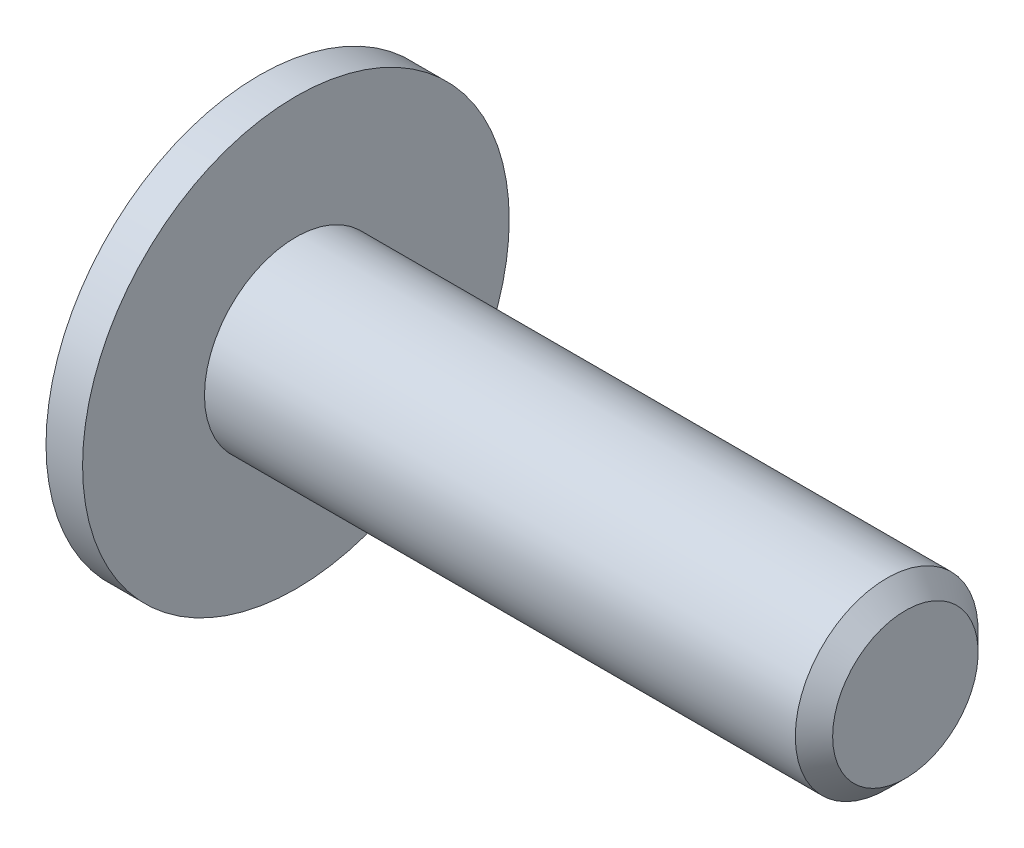
ISO-10303-21;
HEADER;
FILE_DESCRIPTION(('STEP AP214'),'2;1');
FILE_NAME('part.step','',(''),(''),'','','');
FILE_SCHEMA(('AUTOMOTIVE_DESIGN { 1 0 10303 214 1 1 1 1 }'));
ENDSEC;
DATA;
#1=APPLICATION_CONTEXT('core data for automotive mechanical design processes');
#2=APPLICATION_PROTOCOL_DEFINITION('international standard','automotive_design',2000,#1);
#3=PRODUCT_CONTEXT('',#1,'mechanical');
#4=PRODUCT('Part','Part','',(#3));
#5=PRODUCT_RELATED_PRODUCT_CATEGORY('part','',(#4));
#6=PRODUCT_DEFINITION_FORMATION('','',#4);
#7=PRODUCT_DEFINITION_CONTEXT('part definition',#1,'design');
#8=PRODUCT_DEFINITION('design','',#6,#7);
#9=PRODUCT_DEFINITION_SHAPE('','',#8);
#10=(LENGTH_UNIT() NAMED_UNIT(*) SI_UNIT(.MILLI.,.METRE.));
#11=(NAMED_UNIT(*) PLANE_ANGLE_UNIT() SI_UNIT($,.RADIAN.));
#12=(NAMED_UNIT(*) SI_UNIT($,.STERADIAN.) SOLID_ANGLE_UNIT());
#13=UNCERTAINTY_MEASURE_WITH_UNIT(LENGTH_MEASURE(1.E-05),#10,'distance_accuracy_value','');
#14=(GEOMETRIC_REPRESENTATION_CONTEXT(3) GLOBAL_UNCERTAINTY_ASSIGNED_CONTEXT((#13)) GLOBAL_UNIT_ASSIGNED_CONTEXT((#10,
#11,#12)) REPRESENTATION_CONTEXT('',''));
#15=CARTESIAN_POINT('',(0.,0.,0.));
#16=DIRECTION('',(0.,0.,1.));
#17=DIRECTION('',(1.,0.,0.));
#18=AXIS2_PLACEMENT_3D('',#15,#16,#17);
#19=CARTESIAN_POINT('',(-1.65,0.,0.));
#20=DIRECTION('',(1.,0.,0.));
#21=DIRECTION('',(0.,0.,-1.));
#22=AXIS2_PLACEMENT_3D('',#19,#20,#21);
#23=PLANE('',#22);
#24=CARTESIAN_POINT('',(-1.65,0.,0.));
#25=DIRECTION('',(-1.,0.,0.));
#26=DIRECTION('',(0.,0.,1.));
#27=AXIS2_PLACEMENT_3D('',#24,#25,#26);
#28=CIRCLE('',#27,1.95);
#29=CARTESIAN_POINT('',(-1.65,0.,1.95));
#30=VERTEX_POINT('',#29);
#31=EDGE_CURVE('E11',#30,#30,#28,.T.);
#32=ORIENTED_EDGE('',*,*,#31,.T.);
#33=EDGE_LOOP('',(#32));
#34=FACE_BOUND('',#33,.T.);
#35=DIRECTION('',(0.,-1.,0.));
#36=VECTOR('',#35,1.);
#37=CARTESIAN_POINT('',(-1.65,0.57735026918963,1.));
#38=LINE('',#37,#36);
#39=CARTESIAN_POINT('',(-1.65,0.57735026918963,1.));
#40=VERTEX_POINT('',#39);
#41=CARTESIAN_POINT('',(-1.65,-0.57735026918963,1.));
#42=VERTEX_POINT('',#41);
#43=EDGE_CURVE('E53',#40,#42,#38,.T.);
#44=ORIENTED_EDGE('',*,*,#43,.T.);
#45=DIRECTION('',(0.,-0.500000000000029,-0.866025403784422));
#46=VECTOR('',#45,1.);
#47=CARTESIAN_POINT('',(-1.65,-0.57735026918963,1.));
#48=LINE('',#47,#46);
#49=CARTESIAN_POINT('',(-1.65,-1.1547005383793,0.));
#50=VERTEX_POINT('',#49);
#51=EDGE_CURVE('E124',#42,#50,#48,.T.);
#52=ORIENTED_EDGE('',*,*,#51,.T.);
#53=DIRECTION('',(0.,0.500000000000029,-0.866025403784422));
#54=VECTOR('',#53,1.);
#55=CARTESIAN_POINT('',(-1.65,-1.1547005383793,0.));
#56=LINE('',#55,#54);
#57=CARTESIAN_POINT('',(-1.65,-0.57735026918963,-1.));
#58=VERTEX_POINT('',#57);
#59=EDGE_CURVE('E127',#50,#58,#56,.T.);
#60=ORIENTED_EDGE('',*,*,#59,.T.);
#61=DIRECTION('',(0.,1.,0.));
#62=VECTOR('',#61,1.);
#63=CARTESIAN_POINT('',(-1.65,-0.57735026918963,-1.));
#64=LINE('',#63,#62);
#65=CARTESIAN_POINT('',(-1.65,0.57735026918963,-1.));
#66=VERTEX_POINT('',#65);
#67=EDGE_CURVE('E130',#58,#66,#64,.T.);
#68=ORIENTED_EDGE('',*,*,#67,.T.);
#69=DIRECTION('',(0.,0.500000000000029,0.866025403784422));
#70=VECTOR('',#69,1.);
#71=CARTESIAN_POINT('',(-1.65,0.57735026918963,-1.));
#72=LINE('',#71,#70);
#73=CARTESIAN_POINT('',(-1.65,1.1547005383793,0.));
#74=VERTEX_POINT('',#73);
#75=EDGE_CURVE('E114',#66,#74,#72,.T.);
#76=ORIENTED_EDGE('',*,*,#75,.T.);
#77=DIRECTION('',(0.,-0.500000000000029,0.866025403784422));
#78=VECTOR('',#77,1.);
#79=CARTESIAN_POINT('',(-1.65,1.1547005383793,0.));
#80=LINE('',#79,#78);
#81=EDGE_CURVE('E133',#74,#40,#80,.T.);
#82=ORIENTED_EDGE('',*,*,#81,.T.);
#83=EDGE_LOOP('',(#44,#52,#60,#68,#76,#82));
#84=FACE_BOUND('',#83,.T.);
#85=ADVANCED_FACE('F39',(#34,#84),#23,.F.);
#86=CARTESIAN_POINT('',(-0.27250139549985,0.,0.));
#87=DIRECTION('',(-1.,0.,0.));
#88=DIRECTION('',(0.,0.,1.));
#89=AXIS2_PLACEMENT_3D('',#86,#87,#88);
#90=DEGENERATE_TOROIDAL_SURFACE('',#89,0.897886869653605,1.73333333333411,.T.);
#91=ORIENTED_EDGE('',*,*,#31,.F.);
#92=EDGE_LOOP('',(#91));
#93=FACE_BOUND('',#92,.T.);
#94=CARTESIAN_POINT('',(-0.6,0.,0.));
#95=DIRECTION('',(-1.,0.,0.));
#96=DIRECTION('',(0.,0.,1.));
#97=AXIS2_PLACEMENT_3D('',#94,#95,#96);
#98=CIRCLE('',#97,2.6);
#99=CARTESIAN_POINT('',(-0.6,0.,2.6));
#100=VERTEX_POINT('',#99);
#101=EDGE_CURVE('E46',#100,#100,#98,.T.);
#102=ORIENTED_EDGE('',*,*,#101,.T.);
#103=EDGE_LOOP('',(#102));
#104=FACE_BOUND('',#103,.T.);
#105=ADVANCED_FACE('F161',(#93,#104),#90,.T.);
#106=CARTESIAN_POINT('',(-0.6,2.6,0.));
#107=DIRECTION('',(1.,0.,0.));
#108=DIRECTION('',(0.,0.,-1.));
#109=AXIS2_PLACEMENT_3D('',#106,#107,#108);
#110=PLANE('',#109);
#111=ORIENTED_EDGE('',*,*,#101,.F.);
#112=EDGE_LOOP('',(#111));
#113=FACE_BOUND('',#112,.T.);
#114=CARTESIAN_POINT('',(-0.6,0.,0.));
#115=DIRECTION('',(-1.,0.,0.));
#116=DIRECTION('',(0.,0.,1.));
#117=AXIS2_PLACEMENT_3D('',#114,#115,#116);
#118=CIRCLE('',#117,3.5);
#119=CARTESIAN_POINT('',(-0.6,0.,3.5));
#120=VERTEX_POINT('',#119);
#121=EDGE_CURVE('E156',#120,#120,#118,.T.);
#122=ORIENTED_EDGE('',*,*,#121,.T.);
#123=EDGE_LOOP('',(#122));
#124=FACE_BOUND('',#123,.T.);
#125=ADVANCED_FACE('F163',(#113,#124),#110,.F.);
#126=CARTESIAN_POINT('',(10.,0.,0.));
#127=DIRECTION('',(-1.,0.,0.));
#128=DIRECTION('',(0.,0.,1.));
#129=AXIS2_PLACEMENT_3D('',#126,#127,#128);
#130=CYLINDRICAL_SURFACE('',#129,3.5);
#131=ORIENTED_EDGE('',*,*,#121,.F.);
#132=EDGE_LOOP('',(#131));
#133=FACE_BOUND('',#132,.T.);
#134=CARTESIAN_POINT('',(0.,0.,0.));
#135=DIRECTION('',(-1.,0.,0.));
#136=DIRECTION('',(0.,0.,1.));
#137=AXIS2_PLACEMENT_3D('',#134,#135,#136);
#138=CIRCLE('',#137,3.5);
#139=CARTESIAN_POINT('',(0.,0.,3.5));
#140=VERTEX_POINT('',#139);
#141=EDGE_CURVE('E153',#140,#140,#138,.T.);
#142=ORIENTED_EDGE('',*,*,#141,.T.);
#143=EDGE_LOOP('',(#142));
#144=FACE_BOUND('',#143,.T.);
#145=ADVANCED_FACE('F166',(#133,#144),#130,.T.);
#146=CARTESIAN_POINT('',(0.,3.5,0.));
#147=DIRECTION('',(-1.,0.,0.));
#148=DIRECTION('',(0.,0.,1.));
#149=AXIS2_PLACEMENT_3D('',#146,#147,#148);
#150=PLANE('',#149);
#151=ORIENTED_EDGE('',*,*,#141,.F.);
#152=EDGE_LOOP('',(#151));
#153=FACE_BOUND('',#152,.T.);
#154=CARTESIAN_POINT('',(0.,0.,0.));
#155=DIRECTION('',(-1.,0.,0.));
#156=DIRECTION('',(0.,0.,1.));
#157=AXIS2_PLACEMENT_3D('',#154,#155,#156);
#158=CIRCLE('',#157,1.5);
#159=CARTESIAN_POINT('',(0.,0.,1.5));
#160=VERTEX_POINT('',#159);
#161=EDGE_CURVE('E150',#160,#160,#158,.T.);
#162=ORIENTED_EDGE('',*,*,#161,.T.);
#163=EDGE_LOOP('',(#162));
#164=FACE_BOUND('',#163,.T.);
#165=ADVANCED_FACE('F172',(#153,#164),#150,.F.);
#166=CARTESIAN_POINT('',(10.,0.,0.));
#167=DIRECTION('',(-1.,0.,0.));
#168=DIRECTION('',(0.,0.,1.));
#169=AXIS2_PLACEMENT_3D('',#166,#167,#168);
#170=CYLINDRICAL_SURFACE('',#169,1.5);
#171=ORIENTED_EDGE('',*,*,#161,.F.);
#172=EDGE_LOOP('',(#171));
#173=FACE_BOUND('',#172,.T.);
#174=CARTESIAN_POINT('',(9.6935,0.,0.));
#175=DIRECTION('',(-1.,0.,0.));
#176=DIRECTION('',(0.,0.,1.));
#177=AXIS2_PLACEMENT_3D('',#174,#175,#176);
#178=CIRCLE('',#177,1.5);
#179=CARTESIAN_POINT('',(9.6935,0.,1.5));
#180=VERTEX_POINT('',#179);
#181=EDGE_CURVE('E147',#180,#180,#178,.T.);
#182=ORIENTED_EDGE('',*,*,#181,.T.);
#183=EDGE_LOOP('',(#182));
#184=FACE_BOUND('',#183,.T.);
#185=ADVANCED_FACE('F178',(#173,#184),#170,.T.);
#186=CARTESIAN_POINT('',(10.,0.,0.));
#187=DIRECTION('',(-1.,0.,0.));
#188=DIRECTION('',(0.,0.,1.));
#189=AXIS2_PLACEMENT_3D('',#186,#187,#188);
#190=CONICAL_SURFACE('',#189,1.1935,0.785398163397448);
#191=ORIENTED_EDGE('',*,*,#181,.F.);
#192=EDGE_LOOP('',(#191));
#193=FACE_BOUND('',#192,.T.);
#194=CARTESIAN_POINT('',(10.,0.,0.));
#195=DIRECTION('',(-1.,0.,0.));
#196=DIRECTION('',(0.,0.,1.));
#197=AXIS2_PLACEMENT_3D('',#194,#195,#196);
#198=CIRCLE('',#197,1.1935);
#199=CARTESIAN_POINT('',(10.,0.,1.1935));
#200=VERTEX_POINT('',#199);
#201=EDGE_CURVE('E144',#200,#200,#198,.T.);
#202=ORIENTED_EDGE('',*,*,#201,.T.);
#203=EDGE_LOOP('',(#202));
#204=FACE_BOUND('',#203,.T.);
#205=ADVANCED_FACE('F184',(#193,#204),#190,.T.);
#206=CARTESIAN_POINT('',(10.,1.1935,0.));
#207=DIRECTION('',(-1.,0.,0.));
#208=DIRECTION('',(0.,0.,1.));
#209=AXIS2_PLACEMENT_3D('',#206,#207,#208);
#210=PLANE('',#209);
#211=ORIENTED_EDGE('',*,*,#201,.F.);
#212=EDGE_LOOP('',(#211));
#213=FACE_BOUND('',#212,.T.);
#214=ADVANCED_FACE('F190',(#213),#210,.F.);
#215=CARTESIAN_POINT('',(-0.6,0.57735026918963,1.));
#216=DIRECTION('',(0.,0.,-1.));
#217=DIRECTION('',(-1.,0.,0.));
#218=AXIS2_PLACEMENT_3D('',#215,#216,#217);
#219=PLANE('',#218);
#220=ORIENTED_EDGE('',*,*,#43,.F.);
#221=DIRECTION('',(-1.,0.,0.));
#222=VECTOR('',#221,1.);
#223=CARTESIAN_POINT('',(-0.6,0.57735026918963,1.));
#224=LINE('',#223,#222);
#225=CARTESIAN_POINT('',(-0.6,0.57735026918963,1.));
#226=VERTEX_POINT('',#225);
#227=EDGE_CURVE('E119',#226,#40,#224,.T.);
#228=ORIENTED_EDGE('',*,*,#227,.F.);
#229=DIRECTION('',(0.,-1.,0.));
#230=VECTOR('',#229,1.);
#231=CARTESIAN_POINT('',(-0.6,0.57735026918963,1.));
#232=LINE('',#231,#230);
#233=CARTESIAN_POINT('',(-0.6,-0.57735026918963,1.));
#234=VERTEX_POINT('',#233);
#235=EDGE_CURVE('E136',#226,#234,#232,.T.);
#236=ORIENTED_EDGE('',*,*,#235,.T.);
#237=DIRECTION('',(-1.,0.,0.));
#238=VECTOR('',#237,1.);
#239=CARTESIAN_POINT('',(-0.6,-0.57735026918963,1.));
#240=LINE('',#239,#238);
#241=EDGE_CURVE('E142',#234,#42,#240,.T.);
#242=ORIENTED_EDGE('',*,*,#241,.T.);
#243=EDGE_LOOP('',(#220,#228,#236,#242));
#244=FACE_BOUND('',#243,.T.);
#245=ADVANCED_FACE('F195',(#244),#219,.T.);
#246=CARTESIAN_POINT('',(-0.6,-0.57735026918963,1.));
#247=DIRECTION('',(0.,0.866025403784422,-0.500000000000029));
#248=DIRECTION('',(0.,0.500000000000029,0.866025403784422));
#249=AXIS2_PLACEMENT_3D('',#246,#247,#248);
#250=PLANE('',#249);
#251=ORIENTED_EDGE('',*,*,#51,.F.);
#252=ORIENTED_EDGE('',*,*,#241,.F.);
#253=DIRECTION('',(0.,-0.500000000000029,-0.866025403784422));
#254=VECTOR('',#253,1.);
#255=CARTESIAN_POINT('',(-0.6,-0.57735026918963,1.));
#256=LINE('',#255,#254);
#257=CARTESIAN_POINT('',(-0.6,-1.1547005383793,0.));
#258=VERTEX_POINT('',#257);
#259=EDGE_CURVE('E92',#234,#258,#256,.T.);
#260=ORIENTED_EDGE('',*,*,#259,.T.);
#261=DIRECTION('',(-1.,0.,0.));
#262=VECTOR('',#261,1.);
#263=CARTESIAN_POINT('',(-0.6,-1.1547005383793,0.));
#264=LINE('',#263,#262);
#265=EDGE_CURVE('E140',#258,#50,#264,.T.);
#266=ORIENTED_EDGE('',*,*,#265,.T.);
#267=EDGE_LOOP('',(#251,#252,#260,#266));
#268=FACE_BOUND('',#267,.T.);
#269=ADVANCED_FACE('F200',(#268),#250,.T.);
#270=CARTESIAN_POINT('',(-0.6,-1.1547005383793,0.));
#271=DIRECTION('',(0.,0.866025403784422,0.500000000000029));
#272=DIRECTION('',(0.,-0.500000000000029,0.866025403784422));
#273=AXIS2_PLACEMENT_3D('',#270,#271,#272);
#274=PLANE('',#273);
#275=ORIENTED_EDGE('',*,*,#59,.F.);
#276=ORIENTED_EDGE('',*,*,#265,.F.);
#277=DIRECTION('',(0.,0.500000000000029,-0.866025403784422));
#278=VECTOR('',#277,1.);
#279=CARTESIAN_POINT('',(-0.6,-1.1547005383793,0.));
#280=LINE('',#279,#278);
#281=CARTESIAN_POINT('',(-0.6,-0.57735026918963,-1.));
#282=VERTEX_POINT('',#281);
#283=EDGE_CURVE('E110',#258,#282,#280,.T.);
#284=ORIENTED_EDGE('',*,*,#283,.T.);
#285=DIRECTION('',(-1.,0.,0.));
#286=VECTOR('',#285,1.);
#287=CARTESIAN_POINT('',(-0.6,-0.57735026918963,-1.));
#288=LINE('',#287,#286);
#289=EDGE_CURVE('E107',#282,#58,#288,.T.);
#290=ORIENTED_EDGE('',*,*,#289,.T.);
#291=EDGE_LOOP('',(#275,#276,#284,#290));
#292=FACE_BOUND('',#291,.T.);
#293=ADVANCED_FACE('F217',(#292),#274,.T.);
#294=CARTESIAN_POINT('',(-0.6,-0.57735026918963,-1.));
#295=DIRECTION('',(0.,0.,1.));
#296=DIRECTION('',(1.,0.,0.));
#297=AXIS2_PLACEMENT_3D('',#294,#295,#296);
#298=PLANE('',#297);
#299=ORIENTED_EDGE('',*,*,#67,.F.);
#300=ORIENTED_EDGE('',*,*,#289,.F.);
#301=DIRECTION('',(0.,1.,0.));
#302=VECTOR('',#301,1.);
#303=CARTESIAN_POINT('',(-0.6,-0.57735026918963,-1.));
#304=LINE('',#303,#302);
#305=CARTESIAN_POINT('',(-0.6,0.57735026918963,-1.));
#306=VERTEX_POINT('',#305);
#307=EDGE_CURVE('E102',#282,#306,#304,.T.);
#308=ORIENTED_EDGE('',*,*,#307,.T.);
#309=DIRECTION('',(-1.,0.,0.));
#310=VECTOR('',#309,1.);
#311=CARTESIAN_POINT('',(-0.6,0.57735026918963,-1.));
#312=LINE('',#311,#310);
#313=EDGE_CURVE('E106',#306,#66,#312,.T.);
#314=ORIENTED_EDGE('',*,*,#313,.T.);
#315=EDGE_LOOP('',(#299,#300,#308,#314));
#316=FACE_BOUND('',#315,.T.);
#317=ADVANCED_FACE('F105',(#316),#298,.T.);
#318=CARTESIAN_POINT('',(-0.6,0.57735026918963,-1.));
#319=DIRECTION('',(0.,-0.866025403784422,0.500000000000029));
#320=DIRECTION('',(0.,-0.500000000000029,-0.866025403784422));
#321=AXIS2_PLACEMENT_3D('',#318,#319,#320);
#322=PLANE('',#321);
#323=ORIENTED_EDGE('',*,*,#75,.F.);
#324=ORIENTED_EDGE('',*,*,#313,.F.);
#325=DIRECTION('',(0.,0.500000000000029,0.866025403784422));
#326=VECTOR('',#325,1.);
#327=CARTESIAN_POINT('',(-0.6,0.57735026918963,-1.));
#328=LINE('',#327,#326);
#329=CARTESIAN_POINT('',(-0.6,1.1547005383793,0.));
#330=VERTEX_POINT('',#329);
#331=EDGE_CURVE('E109',#306,#330,#328,.T.);
#332=ORIENTED_EDGE('',*,*,#331,.T.);
#333=DIRECTION('',(-1.,0.,0.));
#334=VECTOR('',#333,1.);
#335=CARTESIAN_POINT('',(-0.6,1.1547005383793,0.));
#336=LINE('',#335,#334);
#337=EDGE_CURVE('E83',#330,#74,#336,.T.);
#338=ORIENTED_EDGE('',*,*,#337,.T.);
#339=EDGE_LOOP('',(#323,#324,#332,#338));
#340=FACE_BOUND('',#339,.T.);
#341=ADVANCED_FACE('F112',(#340),#322,.T.);
#342=CARTESIAN_POINT('',(-0.6,1.1547005383793,0.));
#343=DIRECTION('',(0.,-0.866025403784422,-0.500000000000029));
#344=DIRECTION('',(0.,0.500000000000029,-0.866025403784422));
#345=AXIS2_PLACEMENT_3D('',#342,#343,#344);
#346=PLANE('',#345);
#347=ORIENTED_EDGE('',*,*,#81,.F.);
#348=ORIENTED_EDGE('',*,*,#337,.F.);
#349=DIRECTION('',(0.,-0.500000000000029,0.866025403784422));
#350=VECTOR('',#349,1.);
#351=CARTESIAN_POINT('',(-0.6,1.1547005383793,0.));
#352=LINE('',#351,#350);
#353=EDGE_CURVE('E61',#330,#226,#352,.T.);
#354=ORIENTED_EDGE('',*,*,#353,.T.);
#355=ORIENTED_EDGE('',*,*,#227,.T.);
#356=EDGE_LOOP('',(#347,#348,#354,#355));
#357=FACE_BOUND('',#356,.T.);
#358=ADVANCED_FACE('F210',(#357),#346,.T.);
#359=CARTESIAN_POINT('',(-0.6,0.,0.));
#360=DIRECTION('',(1.,0.,0.));
#361=DIRECTION('',(0.,0.,-1.));
#362=AXIS2_PLACEMENT_3D('',#359,#360,#361);
#363=PLANE('',#362);
#364=ORIENTED_EDGE('',*,*,#235,.F.);
#365=ORIENTED_EDGE('',*,*,#353,.F.);
#366=ORIENTED_EDGE('',*,*,#331,.F.);
#367=ORIENTED_EDGE('',*,*,#307,.F.);
#368=ORIENTED_EDGE('',*,*,#283,.F.);
#369=ORIENTED_EDGE('',*,*,#259,.F.);
#370=EDGE_LOOP('',(#364,#365,#366,#367,#368,#369));
#371=FACE_BOUND('',#370,.T.);
#372=ADVANCED_FACE('F117',(#371),#363,.F.);
#373=CLOSED_SHELL('',(#85,#105,#125,#145,#165,#185,#205,#214,#245,#269,#293,#317,#341,#358,#372));
#374=MANIFOLD_SOLID_BREP('B2',#373);
#375=ADVANCED_BREP_SHAPE_REPRESENTATION('',(#18,#374),#14);
#376=SHAPE_DEFINITION_REPRESENTATION(#9,#375);
ENDSEC;
END-ISO-10303-21;
